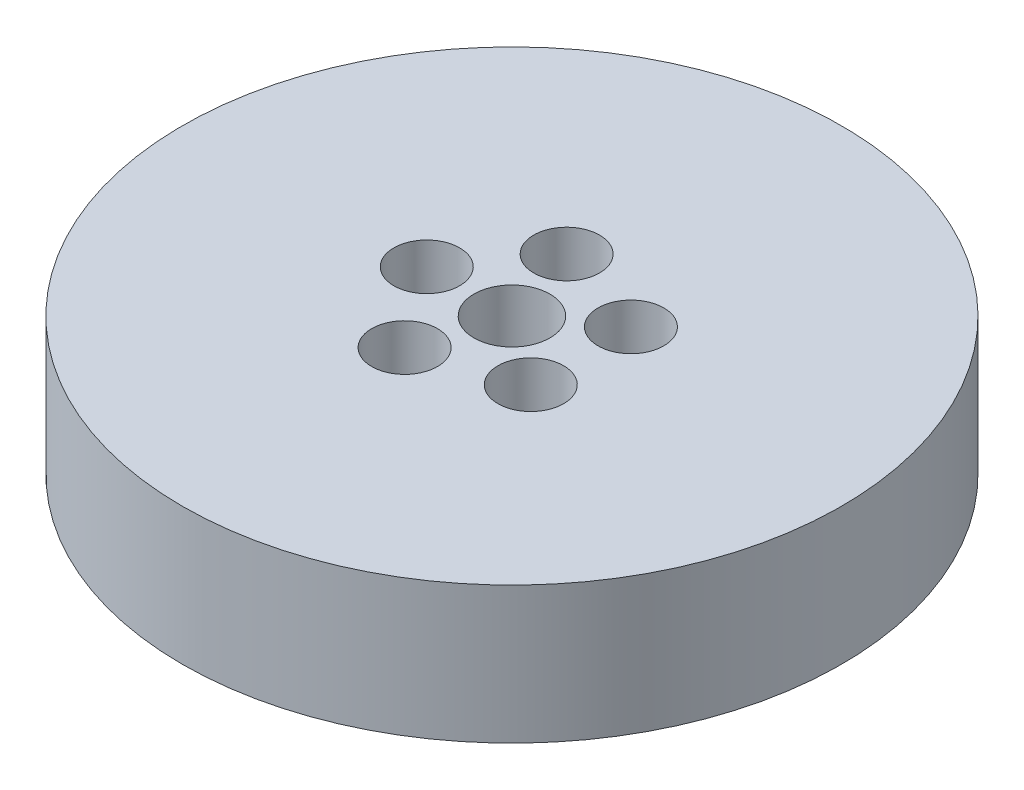
ISO-10303-21;
HEADER;
FILE_DESCRIPTION(('STEP AP214'),'2;1');
FILE_NAME('part.step','',(''),(''),'','','');
FILE_SCHEMA(('AUTOMOTIVE_DESIGN { 1 0 10303 214 1 1 1 1 }'));
ENDSEC;
DATA;
#1=APPLICATION_CONTEXT('core data for automotive mechanical design processes');
#2=APPLICATION_PROTOCOL_DEFINITION('international standard','automotive_design',2000,#1);
#3=PRODUCT_CONTEXT('',#1,'mechanical');
#4=PRODUCT('Part','Part','',(#3));
#5=PRODUCT_RELATED_PRODUCT_CATEGORY('part','',(#4));
#6=PRODUCT_DEFINITION_FORMATION('','',#4);
#7=PRODUCT_DEFINITION_CONTEXT('part definition',#1,'design');
#8=PRODUCT_DEFINITION('design','',#6,#7);
#9=PRODUCT_DEFINITION_SHAPE('','',#8);
#10=(LENGTH_UNIT() NAMED_UNIT(*) SI_UNIT(.MILLI.,.METRE.));
#11=(NAMED_UNIT(*) PLANE_ANGLE_UNIT() SI_UNIT($,.RADIAN.));
#12=(NAMED_UNIT(*) SI_UNIT($,.STERADIAN.) SOLID_ANGLE_UNIT());
#13=UNCERTAINTY_MEASURE_WITH_UNIT(LENGTH_MEASURE(1.E-05),#10,'distance_accuracy_value','');
#14=(GEOMETRIC_REPRESENTATION_CONTEXT(3) GLOBAL_UNCERTAINTY_ASSIGNED_CONTEXT((#13)) GLOBAL_UNIT_ASSIGNED_CONTEXT((#10,
#11,#12)) REPRESENTATION_CONTEXT('',''));
#15=CARTESIAN_POINT('',(0.,0.,0.));
#16=DIRECTION('',(0.,0.,1.));
#17=DIRECTION('',(1.,0.,0.));
#18=AXIS2_PLACEMENT_3D('',#15,#16,#17);
#19=CARTESIAN_POINT('',(0.,27.,0.));
#20=DIRECTION('',(0.,-1.,0.));
#21=DIRECTION('',(0.,0.,-1.));
#22=AXIS2_PLACEMENT_3D('',#19,#20,#21);
#23=CYLINDRICAL_SURFACE('',#22,65.);
#24=CARTESIAN_POINT('',(0.,27.,0.));
#25=DIRECTION('',(0.,1.,0.));
#26=DIRECTION('',(0.,0.,1.));
#27=AXIS2_PLACEMENT_3D('',#24,#25,#26);
#28=CIRCLE('',#27,65.);
#29=CARTESIAN_POINT('',(0.,27.,65.));
#30=VERTEX_POINT('',#29);
#31=EDGE_CURVE('E10',#30,#30,#28,.T.);
#32=ORIENTED_EDGE('',*,*,#31,.F.);
#33=EDGE_LOOP('',(#32));
#34=FACE_BOUND('',#33,.T.);
#35=CARTESIAN_POINT('',(0.,0.,0.));
#36=DIRECTION('',(0.,1.,0.));
#37=DIRECTION('',(0.,0.,1.));
#38=AXIS2_PLACEMENT_3D('',#35,#36,#37);
#39=CIRCLE('',#38,65.);
#40=CARTESIAN_POINT('',(0.,0.,65.));
#41=VERTEX_POINT('',#40);
#42=EDGE_CURVE('E37',#41,#41,#39,.T.);
#43=ORIENTED_EDGE('',*,*,#42,.T.);
#44=EDGE_LOOP('',(#43));
#45=FACE_BOUND('',#44,.T.);
#46=ADVANCED_FACE('F40',(#34,#45),#23,.T.);
#47=CARTESIAN_POINT('',(0.,27.,0.));
#48=DIRECTION('',(0.,1.,0.));
#49=DIRECTION('',(0.,0.,1.));
#50=AXIS2_PLACEMENT_3D('',#47,#48,#49);
#51=PLANE('',#50);
#52=CARTESIAN_POINT('',(-5.19189360258797,27.,-15.9790054674499));
#53=DIRECTION('',(0.,1.,0.));
#54=DIRECTION('',(-0.95105651629515,0.,0.309016994374958));
#55=AXIS2_PLACEMENT_3D('',#52,#53,#54);
#56=CIRCLE('',#55,6.48724829032921);
#57=CARTESIAN_POINT('',(-11.3616333619301,27.,-13.9743354990083));
#58=VERTEX_POINT('',#57);
#59=EDGE_CURVE('E70',#58,#58,#56,.T.);
#60=ORIENTED_EDGE('',*,*,#59,.F.);
#61=EDGE_LOOP('',(#60));
#62=FACE_BOUND('',#61,.T.);
#63=CARTESIAN_POINT('',(13.5925539175479,27.,-9.87556848530459));
#64=DIRECTION('',(0.,1.,0.));
#65=DIRECTION('',(-0.58778525229248,0.,-0.809016994374942));
#66=AXIS2_PLACEMENT_3D('',#63,#64,#65);
#67=CIRCLE('',#66,6.48724829032921);
#68=CARTESIAN_POINT('',(9.77944504453276,27.,-15.1238625989107));
#69=VERTEX_POINT('',#68);
#70=EDGE_CURVE('E71',#69,#69,#67,.T.);
#71=ORIENTED_EDGE('',*,*,#70,.F.);
#72=EDGE_LOOP('',(#71));
#73=FACE_BOUND('',#72,.T.);
#74=CARTESIAN_POINT('',(13.592553917548,27.,9.87556848530439));
#75=DIRECTION('',(0.,1.,0.));
#76=DIRECTION('',(0.587785252292469,0.,-0.809016994374951));
#77=AXIS2_PLACEMENT_3D('',#74,#75,#76);
#78=CIRCLE('',#77,6.48724829032921);
#79=CARTESIAN_POINT('',(17.4056627905631,27.,4.62727437169821));
#80=VERTEX_POINT('',#79);
#81=EDGE_CURVE('E78',#80,#80,#78,.T.);
#82=ORIENTED_EDGE('',*,*,#81,.F.);
#83=EDGE_LOOP('',(#82));
#84=FACE_BOUND('',#83,.T.);
#85=CARTESIAN_POINT('',(-5.19189360258774,27.,15.97900546745));
#86=DIRECTION('',(0.,1.,0.));
#87=DIRECTION('',(0.951056516295155,0.,0.309016994374945));
#88=AXIS2_PLACEMENT_3D('',#85,#86,#87);
#89=CIRCLE('',#88,6.48724829032921);
#90=CARTESIAN_POINT('',(0.977846156754459,27.,17.9836754358915));
#91=VERTEX_POINT('',#90);
#92=EDGE_CURVE('E61',#91,#91,#89,.T.);
#93=ORIENTED_EDGE('',*,*,#92,.F.);
#94=EDGE_LOOP('',(#93));
#95=FACE_BOUND('',#94,.T.);
#96=CARTESIAN_POINT('',(-16.8013206299204,27.,0.));
#97=DIRECTION('',(0.,1.,0.));
#98=DIRECTION('',(0.,0.,1.));
#99=AXIS2_PLACEMENT_3D('',#96,#97,#98);
#100=CIRCLE('',#99,6.48724829032921);
#101=CARTESIAN_POINT('',(-16.8013206299204,27.,6.48724829032921));
#102=VERTEX_POINT('',#101);
#103=EDGE_CURVE('E54',#102,#102,#100,.T.);
#104=ORIENTED_EDGE('',*,*,#103,.F.);
#105=EDGE_LOOP('',(#104));
#106=FACE_BOUND('',#105,.T.);
#107=CARTESIAN_POINT('',(0.,27.,0.));
#108=DIRECTION('',(0.,1.,0.));
#109=DIRECTION('',(0.,0.,1.));
#110=AXIS2_PLACEMENT_3D('',#107,#108,#109);
#111=CIRCLE('',#110,7.5);
#112=CARTESIAN_POINT('',(0.,27.,7.5));
#113=VERTEX_POINT('',#112);
#114=EDGE_CURVE('E50',#113,#113,#111,.T.);
#115=ORIENTED_EDGE('',*,*,#114,.F.);
#116=EDGE_LOOP('',(#115));
#117=FACE_BOUND('',#116,.T.);
#118=ORIENTED_EDGE('',*,*,#31,.T.);
#119=EDGE_LOOP('',(#118));
#120=FACE_BOUND('',#119,.T.);
#121=ADVANCED_FACE('F94',(#62,#73,#84,#95,#106,#117,#120),#51,.T.);
#122=CARTESIAN_POINT('',(0.,0.,0.));
#123=DIRECTION('',(0.,1.,0.));
#124=DIRECTION('',(0.,0.,1.));
#125=AXIS2_PLACEMENT_3D('',#122,#123,#124);
#126=PLANE('',#125);
#127=CARTESIAN_POINT('',(0.,0.,0.));
#128=DIRECTION('',(0.,1.,0.));
#129=DIRECTION('',(0.,0.,1.));
#130=AXIS2_PLACEMENT_3D('',#127,#128,#129);
#131=CIRCLE('',#130,7.5);
#132=CARTESIAN_POINT('',(0.,0.,7.5));
#133=VERTEX_POINT('',#132);
#134=EDGE_CURVE('E47',#133,#133,#131,.T.);
#135=ORIENTED_EDGE('',*,*,#134,.T.);
#136=EDGE_LOOP('',(#135));
#137=FACE_BOUND('',#136,.T.);
#138=ORIENTED_EDGE('',*,*,#42,.F.);
#139=EDGE_LOOP('',(#138));
#140=FACE_BOUND('',#139,.T.);
#141=ADVANCED_FACE('F100',(#137,#140),#126,.F.);
#142=CARTESIAN_POINT('',(0.,27.,0.));
#143=DIRECTION('',(0.,-1.,0.));
#144=DIRECTION('',(0.,0.,-1.));
#145=AXIS2_PLACEMENT_3D('',#142,#143,#144);
#146=CYLINDRICAL_SURFACE('',#145,7.5);
#147=ORIENTED_EDGE('',*,*,#114,.T.);
#148=EDGE_LOOP('',(#147));
#149=FACE_BOUND('',#148,.T.);
#150=ORIENTED_EDGE('',*,*,#134,.F.);
#151=EDGE_LOOP('',(#150));
#152=FACE_BOUND('',#151,.T.);
#153=ADVANCED_FACE('F106',(#149,#152),#146,.F.);
#154=CARTESIAN_POINT('',(-16.8013206299204,5.99489281061296,0.));
#155=DIRECTION('',(0.,1.,0.));
#156=DIRECTION('',(0.,0.,1.));
#157=AXIS2_PLACEMENT_3D('',#154,#155,#156);
#158=CYLINDRICAL_SURFACE('',#157,6.48724829032921);
#159=CARTESIAN_POINT('',(-16.8013206299204,5.99489281061296,0.));
#160=DIRECTION('',(0.,1.,0.));
#161=DIRECTION('',(0.,0.,1.));
#162=AXIS2_PLACEMENT_3D('',#159,#160,#161);
#163=CIRCLE('',#162,6.48724829032921);
#164=CARTESIAN_POINT('',(-16.8013206299204,5.99489281061296,6.48724829032921));
#165=VERTEX_POINT('',#164);
#166=EDGE_CURVE('E55',#165,#165,#163,.T.);
#167=ORIENTED_EDGE('',*,*,#166,.F.);
#168=EDGE_LOOP('',(#167));
#169=FACE_BOUND('',#168,.T.);
#170=ORIENTED_EDGE('',*,*,#103,.T.);
#171=EDGE_LOOP('',(#170));
#172=FACE_BOUND('',#171,.T.);
#173=ADVANCED_FACE('F108',(#169,#172),#158,.F.);
#174=CARTESIAN_POINT('',(-16.8013206299204,5.99489281061296,0.));
#175=DIRECTION('',(0.,1.,0.));
#176=DIRECTION('',(0.,0.,1.));
#177=AXIS2_PLACEMENT_3D('',#174,#175,#176);
#178=PLANE('',#177);
#179=ORIENTED_EDGE('',*,*,#166,.T.);
#180=EDGE_LOOP('',(#179));
#181=FACE_BOUND('',#180,.T.);
#182=ADVANCED_FACE('F138',(#181),#178,.T.);
#183=CARTESIAN_POINT('',(-5.19189360258774,5.99489281061296,15.97900546745));
#184=DIRECTION('',(0.,1.,0.));
#185=DIRECTION('',(0.,0.,1.));
#186=AXIS2_PLACEMENT_3D('',#183,#184,#185);
#187=CYLINDRICAL_SURFACE('',#186,6.48724829032921);
#188=CARTESIAN_POINT('',(-5.19189360258774,5.99489281061296,15.97900546745));
#189=DIRECTION('',(0.,1.,0.));
#190=DIRECTION('',(0.951056516295155,0.,0.309016994374945));
#191=AXIS2_PLACEMENT_3D('',#188,#189,#190);
#192=CIRCLE('',#191,6.48724829032921);
#193=CARTESIAN_POINT('',(0.977846156754459,5.99489281061296,17.9836754358915));
#194=VERTEX_POINT('',#193);
#195=EDGE_CURVE('E59',#194,#194,#192,.T.);
#196=ORIENTED_EDGE('',*,*,#195,.F.);
#197=EDGE_LOOP('',(#196));
#198=FACE_BOUND('',#197,.T.);
#199=ORIENTED_EDGE('',*,*,#92,.T.);
#200=EDGE_LOOP('',(#199));
#201=FACE_BOUND('',#200,.T.);
#202=ADVANCED_FACE('F150',(#198,#201),#187,.F.);
#203=CARTESIAN_POINT('',(-5.19189360258774,5.99489281061296,15.97900546745));
#204=DIRECTION('',(0.,1.,0.));
#205=DIRECTION('',(0.951056516295155,0.,0.309016994374945));
#206=AXIS2_PLACEMENT_3D('',#203,#204,#205);
#207=PLANE('',#206);
#208=ORIENTED_EDGE('',*,*,#195,.T.);
#209=EDGE_LOOP('',(#208));
#210=FACE_BOUND('',#209,.T.);
#211=ADVANCED_FACE('F89',(#210),#207,.T.);
#212=CARTESIAN_POINT('',(13.592553917548,5.99489281061296,9.87556848530439));
#213=DIRECTION('',(0.,1.,0.));
#214=DIRECTION('',(0.,0.,1.));
#215=AXIS2_PLACEMENT_3D('',#212,#213,#214);
#216=CYLINDRICAL_SURFACE('',#215,6.48724829032921);
#217=CARTESIAN_POINT('',(13.592553917548,5.99489281061296,9.87556848530439));
#218=DIRECTION('',(0.,1.,0.));
#219=DIRECTION('',(0.587785252292469,0.,-0.809016994374951));
#220=AXIS2_PLACEMENT_3D('',#217,#218,#219);
#221=CIRCLE('',#220,6.48724829032921);
#222=CARTESIAN_POINT('',(17.4056627905631,5.99489281061296,4.62727437169821));
#223=VERTEX_POINT('',#222);
#224=EDGE_CURVE('E63',#223,#223,#221,.T.);
#225=ORIENTED_EDGE('',*,*,#224,.F.);
#226=EDGE_LOOP('',(#225));
#227=FACE_BOUND('',#226,.T.);
#228=ORIENTED_EDGE('',*,*,#81,.T.);
#229=EDGE_LOOP('',(#228));
#230=FACE_BOUND('',#229,.T.);
#231=ADVANCED_FACE('F87',(#227,#230),#216,.F.);
#232=CARTESIAN_POINT('',(13.592553917548,5.99489281061296,9.87556848530439));
#233=DIRECTION('',(0.,1.,0.));
#234=DIRECTION('',(0.587785252292469,0.,-0.809016994374951));
#235=AXIS2_PLACEMENT_3D('',#232,#233,#234);
#236=PLANE('',#235);
#237=ORIENTED_EDGE('',*,*,#224,.T.);
#238=EDGE_LOOP('',(#237));
#239=FACE_BOUND('',#238,.T.);
#240=ADVANCED_FACE('F84',(#239),#236,.T.);
#241=CARTESIAN_POINT('',(13.5925539175479,5.99489281061296,-9.87556848530459));
#242=DIRECTION('',(0.,1.,0.));
#243=DIRECTION('',(0.,0.,1.));
#244=AXIS2_PLACEMENT_3D('',#241,#242,#243);
#245=CYLINDRICAL_SURFACE('',#244,6.48724829032921);
#246=CARTESIAN_POINT('',(13.5925539175479,5.99489281061296,-9.87556848530459));
#247=DIRECTION('',(0.,1.,0.));
#248=DIRECTION('',(-0.58778525229248,0.,-0.809016994374942));
#249=AXIS2_PLACEMENT_3D('',#246,#247,#248);
#250=CIRCLE('',#249,6.48724829032921);
#251=CARTESIAN_POINT('',(9.77944504453276,5.99489281061296,-15.1238625989107));
#252=VERTEX_POINT('',#251);
#253=EDGE_CURVE('E76',#252,#252,#250,.T.);
#254=ORIENTED_EDGE('',*,*,#253,.F.);
#255=EDGE_LOOP('',(#254));
#256=FACE_BOUND('',#255,.T.);
#257=ORIENTED_EDGE('',*,*,#70,.T.);
#258=EDGE_LOOP('',(#257));
#259=FACE_BOUND('',#258,.T.);
#260=ADVANCED_FACE('F185',(#256,#259),#245,.F.);
#261=CARTESIAN_POINT('',(13.5925539175479,5.99489281061296,-9.87556848530459));
#262=DIRECTION('',(0.,1.,0.));
#263=DIRECTION('',(-0.58778525229248,0.,-0.809016994374942));
#264=AXIS2_PLACEMENT_3D('',#261,#262,#263);
#265=PLANE('',#264);
#266=ORIENTED_EDGE('',*,*,#253,.T.);
#267=EDGE_LOOP('',(#266));
#268=FACE_BOUND('',#267,.T.);
#269=ADVANCED_FACE('F189',(#268),#265,.T.);
#270=CARTESIAN_POINT('',(-5.19189360258797,5.99489281061296,-15.9790054674499));
#271=DIRECTION('',(0.,1.,0.));
#272=DIRECTION('',(0.,0.,1.));
#273=AXIS2_PLACEMENT_3D('',#270,#271,#272);
#274=CYLINDRICAL_SURFACE('',#273,6.48724829032921);
#275=CARTESIAN_POINT('',(-5.19189360258797,5.99489281061296,-15.9790054674499));
#276=DIRECTION('',(0.,1.,0.));
#277=DIRECTION('',(-0.95105651629515,0.,0.309016994374958));
#278=AXIS2_PLACEMENT_3D('',#275,#276,#277);
#279=CIRCLE('',#278,6.48724829032921);
#280=CARTESIAN_POINT('',(-11.3616333619301,5.99489281061296,-13.9743354990083));
#281=VERTEX_POINT('',#280);
#282=EDGE_CURVE('E69',#281,#281,#279,.T.);
#283=ORIENTED_EDGE('',*,*,#282,.F.);
#284=EDGE_LOOP('',(#283));
#285=FACE_BOUND('',#284,.T.);
#286=ORIENTED_EDGE('',*,*,#59,.T.);
#287=EDGE_LOOP('',(#286));
#288=FACE_BOUND('',#287,.T.);
#289=ADVANCED_FACE('F200',(#285,#288),#274,.F.);
#290=CARTESIAN_POINT('',(-5.19189360258797,5.99489281061296,-15.9790054674499));
#291=DIRECTION('',(0.,1.,0.));
#292=DIRECTION('',(-0.95105651629515,0.,0.309016994374958));
#293=AXIS2_PLACEMENT_3D('',#290,#291,#292);
#294=PLANE('',#293);
#295=ORIENTED_EDGE('',*,*,#282,.T.);
#296=EDGE_LOOP('',(#295));
#297=FACE_BOUND('',#296,.T.);
#298=ADVANCED_FACE('F208',(#297),#294,.T.);
#299=CLOSED_SHELL('',(#46,#121,#141,#153,#173,#182,#202,#211,#231,#240,#260,#269,#289,#298));
#300=MANIFOLD_SOLID_BREP('B2',#299);
#301=ADVANCED_BREP_SHAPE_REPRESENTATION('',(#18,#300),#14);
#302=SHAPE_DEFINITION_REPRESENTATION(#9,#301);
ENDSEC;
END-ISO-10303-21;
